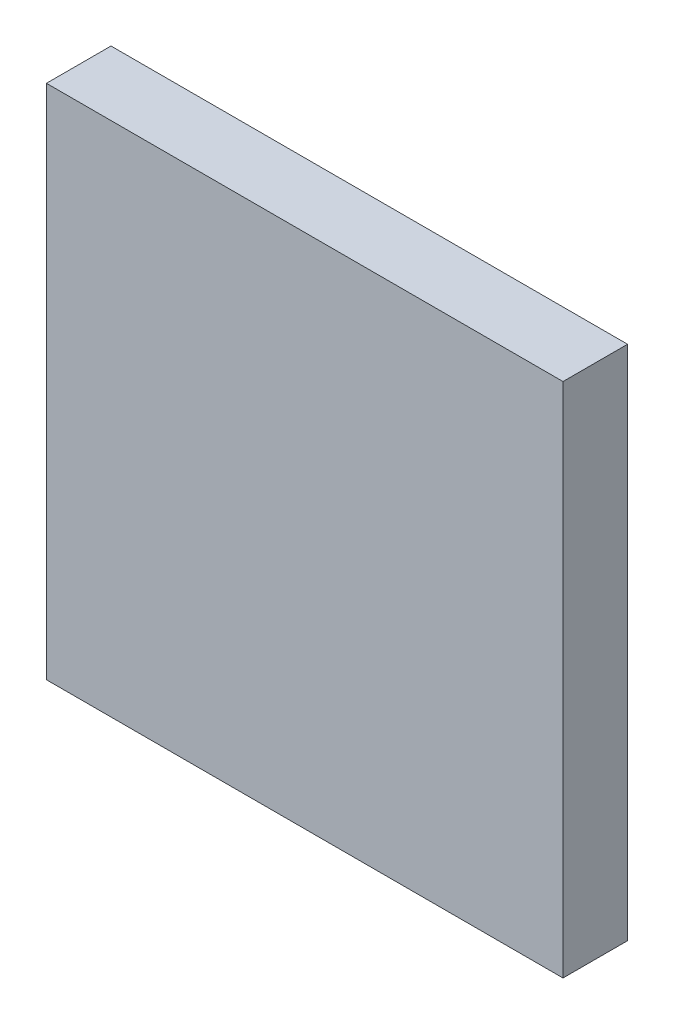
ISO-10303-21;
HEADER;
FILE_DESCRIPTION(('STEP AP214'),'2;1');
FILE_NAME('part.step','',(''),(''),'','','');
FILE_SCHEMA(('AUTOMOTIVE_DESIGN { 1 0 10303 214 1 1 1 1 }'));
ENDSEC;
DATA;
#1=APPLICATION_CONTEXT('core data for automotive mechanical design processes');
#2=APPLICATION_PROTOCOL_DEFINITION('international standard','automotive_design',2000,#1);
#3=PRODUCT_CONTEXT('',#1,'mechanical');
#4=PRODUCT('Part','Part','',(#3));
#5=PRODUCT_RELATED_PRODUCT_CATEGORY('part','',(#4));
#6=PRODUCT_DEFINITION_FORMATION('','',#4);
#7=PRODUCT_DEFINITION_CONTEXT('part definition',#1,'design');
#8=PRODUCT_DEFINITION('design','',#6,#7);
#9=PRODUCT_DEFINITION_SHAPE('','',#8);
#10=(LENGTH_UNIT() NAMED_UNIT(*) SI_UNIT(.MILLI.,.METRE.));
#11=(NAMED_UNIT(*) PLANE_ANGLE_UNIT() SI_UNIT($,.RADIAN.));
#12=(NAMED_UNIT(*) SI_UNIT($,.STERADIAN.) SOLID_ANGLE_UNIT());
#13=UNCERTAINTY_MEASURE_WITH_UNIT(LENGTH_MEASURE(1.E-05),#10,'distance_accuracy_value','');
#14=(GEOMETRIC_REPRESENTATION_CONTEXT(3) GLOBAL_UNCERTAINTY_ASSIGNED_CONTEXT((#13)) GLOBAL_UNIT_ASSIGNED_CONTEXT((#10,
#11,#12)) REPRESENTATION_CONTEXT('',''));
#15=CARTESIAN_POINT('',(0.,0.,0.));
#16=DIRECTION('',(0.,0.,1.));
#17=DIRECTION('',(1.,0.,0.));
#18=AXIS2_PLACEMENT_3D('',#15,#16,#17);
#19=CARTESIAN_POINT('',(3.99999962,-3.99999962,1.00000054));
#20=DIRECTION('',(0.,0.,-1.));
#21=DIRECTION('',(0.,-1.,0.));
#22=AXIS2_PLACEMENT_3D('',#19,#20,#21);
#23=PLANE('',#22);
#24=DIRECTION('',(0.,1.,0.));
#25=VECTOR('',#24,1.);
#26=CARTESIAN_POINT('',(3.99999962,-3.99999962,1.00000054));
#27=LINE('',#26,#25);
#28=CARTESIAN_POINT('',(3.99999962,-3.99999962,1.00000054));
#29=VERTEX_POINT('',#28);
#30=CARTESIAN_POINT('',(3.99999962,3.99999962,1.00000054));
#31=VERTEX_POINT('',#30);
#32=EDGE_CURVE('E78',#29,#31,#27,.T.);
#33=ORIENTED_EDGE('',*,*,#32,.T.);
#34=DIRECTION('',(-1.,0.,0.));
#35=VECTOR('',#34,1.);
#36=CARTESIAN_POINT('',(3.99999962,3.99999962,1.00000054));
#37=LINE('',#36,#35);
#38=CARTESIAN_POINT('',(-3.99999962,3.99999962,1.00000054));
#39=VERTEX_POINT('',#38);
#40=EDGE_CURVE('E76',#31,#39,#37,.T.);
#41=ORIENTED_EDGE('',*,*,#40,.T.);
#42=DIRECTION('',(0.,-1.,0.));
#43=VECTOR('',#42,1.);
#44=CARTESIAN_POINT('',(-3.99999962,3.99999962,1.00000054));
#45=LINE('',#44,#43);
#46=CARTESIAN_POINT('',(-3.99999962,-3.99999962,1.00000054));
#47=VERTEX_POINT('',#46);
#48=EDGE_CURVE('E64',#39,#47,#45,.T.);
#49=ORIENTED_EDGE('',*,*,#48,.T.);
#50=DIRECTION('',(1.,0.,0.));
#51=VECTOR('',#50,1.);
#52=CARTESIAN_POINT('',(-3.99999962,-3.99999962,1.00000054));
#53=LINE('',#52,#51);
#54=EDGE_CURVE('E11',#47,#29,#53,.T.);
#55=ORIENTED_EDGE('',*,*,#54,.T.);
#56=EDGE_LOOP('',(#33,#41,#49,#55));
#57=FACE_BOUND('',#56,.T.);
#58=ADVANCED_FACE('F17',(#57),#23,.F.);
#59=CARTESIAN_POINT('',(3.99999962,-3.99999962,0.));
#60=DIRECTION('',(0.,0.,-1.));
#61=DIRECTION('',(0.,-1.,0.));
#62=AXIS2_PLACEMENT_3D('',#59,#60,#61);
#63=PLANE('',#62);
#64=DIRECTION('',(1.,0.,0.));
#65=VECTOR('',#64,1.);
#66=CARTESIAN_POINT('',(-3.99999962,-3.99999962,0.));
#67=LINE('',#66,#65);
#68=CARTESIAN_POINT('',(-3.99999962,-3.99999962,0.));
#69=VERTEX_POINT('',#68);
#70=CARTESIAN_POINT('',(3.99999962,-3.99999962,0.));
#71=VERTEX_POINT('',#70);
#72=EDGE_CURVE('E20',#69,#71,#67,.T.);
#73=ORIENTED_EDGE('',*,*,#72,.F.);
#74=DIRECTION('',(0.,-1.,0.));
#75=VECTOR('',#74,1.);
#76=CARTESIAN_POINT('',(-3.99999962,3.99999962,0.));
#77=LINE('',#76,#75);
#78=CARTESIAN_POINT('',(-3.99999962,3.99999962,0.));
#79=VERTEX_POINT('',#78);
#80=EDGE_CURVE('E83',#79,#69,#77,.T.);
#81=ORIENTED_EDGE('',*,*,#80,.F.);
#82=DIRECTION('',(-1.,0.,0.));
#83=VECTOR('',#82,1.);
#84=CARTESIAN_POINT('',(3.99999962,3.99999962,0.));
#85=LINE('',#84,#83);
#86=CARTESIAN_POINT('',(3.99999962,3.99999962,0.));
#87=VERTEX_POINT('',#86);
#88=EDGE_CURVE('E85',#87,#79,#85,.T.);
#89=ORIENTED_EDGE('',*,*,#88,.F.);
#90=DIRECTION('',(0.,1.,0.));
#91=VECTOR('',#90,1.);
#92=CARTESIAN_POINT('',(3.99999962,-3.99999962,0.));
#93=LINE('',#92,#91);
#94=EDGE_CURVE('E106',#71,#87,#93,.T.);
#95=ORIENTED_EDGE('',*,*,#94,.F.);
#96=EDGE_LOOP('',(#73,#81,#89,#95));
#97=FACE_BOUND('',#96,.T.);
#98=ADVANCED_FACE('F116',(#97),#63,.T.);
#99=CARTESIAN_POINT('',(-3.99999962,-3.99999962,0.));
#100=DIRECTION('',(0.,1.,0.));
#101=DIRECTION('',(1.,0.,0.));
#102=AXIS2_PLACEMENT_3D('',#99,#100,#101);
#103=PLANE('',#102);
#104=ORIENTED_EDGE('',*,*,#72,.T.);
#105=DIRECTION('',(0.,0.,1.));
#106=VECTOR('',#105,1.);
#107=CARTESIAN_POINT('',(3.99999962,-3.99999962,0.));
#108=LINE('',#107,#106);
#109=EDGE_CURVE('E92',#71,#29,#108,.T.);
#110=ORIENTED_EDGE('',*,*,#109,.T.);
#111=ORIENTED_EDGE('',*,*,#54,.F.);
#112=DIRECTION('',(0.,0.,1.));
#113=VECTOR('',#112,1.);
#114=CARTESIAN_POINT('',(-3.99999962,-3.99999962,0.));
#115=LINE('',#114,#113);
#116=EDGE_CURVE('E71',#69,#47,#115,.T.);
#117=ORIENTED_EDGE('',*,*,#116,.F.);
#118=EDGE_LOOP('',(#104,#110,#111,#117));
#119=FACE_BOUND('',#118,.T.);
#120=ADVANCED_FACE('F120',(#119),#103,.F.);
#121=CARTESIAN_POINT('',(-3.99999962,3.99999962,0.));
#122=DIRECTION('',(1.,0.,0.));
#123=DIRECTION('',(0.,1.,0.));
#124=AXIS2_PLACEMENT_3D('',#121,#122,#123);
#125=PLANE('',#124);
#126=ORIENTED_EDGE('',*,*,#80,.T.);
#127=ORIENTED_EDGE('',*,*,#116,.T.);
#128=ORIENTED_EDGE('',*,*,#48,.F.);
#129=DIRECTION('',(0.,0.,1.));
#130=VECTOR('',#129,1.);
#131=CARTESIAN_POINT('',(-3.99999962,3.99999962,0.));
#132=LINE('',#131,#130);
#133=EDGE_CURVE('E69',#79,#39,#132,.T.);
#134=ORIENTED_EDGE('',*,*,#133,.F.);
#135=EDGE_LOOP('',(#126,#127,#128,#134));
#136=FACE_BOUND('',#135,.T.);
#137=ADVANCED_FACE('F67',(#136),#125,.F.);
#138=CARTESIAN_POINT('',(3.99999962,3.99999962,0.));
#139=DIRECTION('',(0.,-1.,0.));
#140=DIRECTION('',(0.,0.,-1.));
#141=AXIS2_PLACEMENT_3D('',#138,#139,#140);
#142=PLANE('',#141);
#143=ORIENTED_EDGE('',*,*,#88,.T.);
#144=ORIENTED_EDGE('',*,*,#133,.T.);
#145=ORIENTED_EDGE('',*,*,#40,.F.);
#146=DIRECTION('',(0.,0.,1.));
#147=VECTOR('',#146,1.);
#148=CARTESIAN_POINT('',(3.99999962,3.99999962,0.));
#149=LINE('',#148,#147);
#150=EDGE_CURVE('E99',#87,#31,#149,.T.);
#151=ORIENTED_EDGE('',*,*,#150,.F.);
#152=EDGE_LOOP('',(#143,#144,#145,#151));
#153=FACE_BOUND('',#152,.T.);
#154=ADVANCED_FACE('F84',(#153),#142,.F.);
#155=CARTESIAN_POINT('',(3.99999962,-3.99999962,0.));
#156=DIRECTION('',(-1.,0.,0.));
#157=DIRECTION('',(0.,0.,1.));
#158=AXIS2_PLACEMENT_3D('',#155,#156,#157);
#159=PLANE('',#158);
#160=ORIENTED_EDGE('',*,*,#94,.T.);
#161=ORIENTED_EDGE('',*,*,#150,.T.);
#162=ORIENTED_EDGE('',*,*,#32,.F.);
#163=ORIENTED_EDGE('',*,*,#109,.F.);
#164=EDGE_LOOP('',(#160,#161,#162,#163));
#165=FACE_BOUND('',#164,.T.);
#166=ADVANCED_FACE('F114',(#165),#159,.F.);
#167=CLOSED_SHELL('',(#58,#98,#120,#137,#154,#166));
#168=MANIFOLD_SOLID_BREP('B1',#167);
#169=ADVANCED_BREP_SHAPE_REPRESENTATION('',(#18,#168),#14);
#170=SHAPE_DEFINITION_REPRESENTATION(#9,#169);
ENDSEC;
END-ISO-10303-21;
